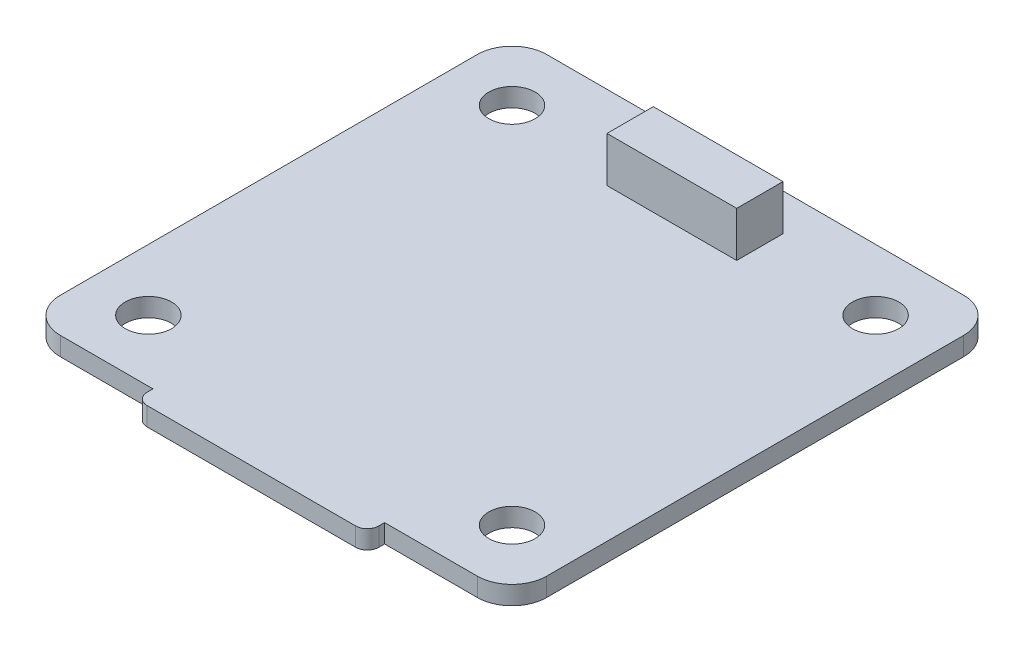
ISO-10303-21;
HEADER;
FILE_DESCRIPTION(('STEP AP214'),'2;1');
FILE_NAME('part.step','',(''),(''),'','','');
FILE_SCHEMA(('AUTOMOTIVE_DESIGN { 1 0 10303 214 1 1 1 1 }'));
ENDSEC;
DATA;
#1=APPLICATION_CONTEXT('core data for automotive mechanical design processes');
#2=APPLICATION_PROTOCOL_DEFINITION('international standard','automotive_design',2000,#1);
#3=PRODUCT_CONTEXT('',#1,'mechanical');
#4=PRODUCT('Part','Part','',(#3));
#5=PRODUCT_RELATED_PRODUCT_CATEGORY('part','',(#4));
#6=PRODUCT_DEFINITION_FORMATION('','',#4);
#7=PRODUCT_DEFINITION_CONTEXT('part definition',#1,'design');
#8=PRODUCT_DEFINITION('design','',#6,#7);
#9=PRODUCT_DEFINITION_SHAPE('','',#8);
#10=(LENGTH_UNIT() NAMED_UNIT(*) SI_UNIT(.MILLI.,.METRE.));
#11=(NAMED_UNIT(*) PLANE_ANGLE_UNIT() SI_UNIT($,.RADIAN.));
#12=(NAMED_UNIT(*) SI_UNIT($,.STERADIAN.) SOLID_ANGLE_UNIT());
#13=UNCERTAINTY_MEASURE_WITH_UNIT(LENGTH_MEASURE(1.E-05),#10,'distance_accuracy_value','');
#14=(GEOMETRIC_REPRESENTATION_CONTEXT(3) GLOBAL_UNCERTAINTY_ASSIGNED_CONTEXT((#13)) GLOBAL_UNIT_ASSIGNED_CONTEXT((#10,
#11,#12)) REPRESENTATION_CONTEXT('',''));
#15=CARTESIAN_POINT('',(0.,0.,0.));
#16=DIRECTION('',(0.,0.,1.));
#17=DIRECTION('',(1.,0.,0.));
#18=AXIS2_PLACEMENT_3D('',#15,#16,#17);
#19=CARTESIAN_POINT('',(-18.,1.6,-18.));
#20=DIRECTION('',(0.,1.,0.));
#21=DIRECTION('',(0.,0.,1.));
#22=AXIS2_PLACEMENT_3D('',#19,#20,#21);
#23=PLANE('',#22);
#24=CARTESIAN_POINT('',(15.6966991411009,1.6,-15.6966991411009));
#25=DIRECTION('',(0.,1.,0.));
#26=DIRECTION('',(0.,0.,1.));
#27=AXIS2_PLACEMENT_3D('',#24,#25,#26);
#28=CIRCLE('',#27,2.);
#29=CARTESIAN_POINT('',(15.6966991411009,1.6,-13.6966991411009));
#30=VERTEX_POINT('',#29);
#31=EDGE_CURVE('E333',#30,#30,#28,.T.);
#32=ORIENTED_EDGE('',*,*,#31,.F.);
#33=EDGE_LOOP('',(#32));
#34=FACE_BOUND('',#33,.T.);
#35=CARTESIAN_POINT('',(-15.6966991411009,1.6,15.6966991411009));
#36=DIRECTION('',(0.,1.,0.));
#37=DIRECTION('',(0.,0.,1.));
#38=AXIS2_PLACEMENT_3D('',#35,#36,#37);
#39=CIRCLE('',#38,2.);
#40=CARTESIAN_POINT('',(-15.6966991411009,1.6,17.6966991411009));
#41=VERTEX_POINT('',#40);
#42=EDGE_CURVE('E189',#41,#41,#39,.T.);
#43=ORIENTED_EDGE('',*,*,#42,.F.);
#44=EDGE_LOOP('',(#43));
#45=FACE_BOUND('',#44,.T.);
#46=CARTESIAN_POINT('',(-18.,1.6,-18.));
#47=DIRECTION('',(0.,1.,0.));
#48=DIRECTION('',(0.,0.,1.));
#49=AXIS2_PLACEMENT_3D('',#46,#47,#48);
#50=CIRCLE('',#49,3.);
#51=CARTESIAN_POINT('',(-18.,1.6,-21.));
#52=VERTEX_POINT('',#51);
#53=CARTESIAN_POINT('',(-21.,1.6,-18.));
#54=VERTEX_POINT('',#53);
#55=EDGE_CURVE('E121',#52,#54,#50,.T.);
#56=ORIENTED_EDGE('',*,*,#55,.T.);
#57=DIRECTION('',(0.,0.,-1.));
#58=VECTOR('',#57,1.);
#59=CARTESIAN_POINT('',(-21.,1.6,18.));
#60=LINE('',#59,#58);
#61=CARTESIAN_POINT('',(-21.,1.6,18.));
#62=VERTEX_POINT('',#61);
#63=EDGE_CURVE('E257',#62,#54,#60,.T.);
#64=ORIENTED_EDGE('',*,*,#63,.F.);
#65=CARTESIAN_POINT('',(-18.,1.6,18.));
#66=DIRECTION('',(0.,1.,0.));
#67=DIRECTION('',(0.,0.,1.));
#68=AXIS2_PLACEMENT_3D('',#65,#66,#67);
#69=CIRCLE('',#68,3.);
#70=CARTESIAN_POINT('',(-18.,1.6,21.));
#71=VERTEX_POINT('',#70);
#72=EDGE_CURVE('E247',#62,#71,#69,.T.);
#73=ORIENTED_EDGE('',*,*,#72,.T.);
#74=DIRECTION('',(1.,0.,0.));
#75=VECTOR('',#74,1.);
#76=CARTESIAN_POINT('',(-18.,1.6,21.));
#77=LINE('',#76,#75);
#78=CARTESIAN_POINT('',(-10.,1.6,21.));
#79=VERTEX_POINT('',#78);
#80=EDGE_CURVE('E300',#71,#79,#77,.T.);
#81=ORIENTED_EDGE('',*,*,#80,.T.);
#82=DIRECTION('',(0.,0.,1.));
#83=VECTOR('',#82,1.);
#84=CARTESIAN_POINT('',(-10.,1.6,21.));
#85=LINE('',#84,#83);
#86=CARTESIAN_POINT('',(-10.,1.6,21.5));
#87=VERTEX_POINT('',#86);
#88=EDGE_CURVE('E296',#79,#87,#85,.T.);
#89=ORIENTED_EDGE('',*,*,#88,.T.);
#90=CARTESIAN_POINT('',(-9.,1.6,21.5));
#91=DIRECTION('',(0.,-1.,0.));
#92=DIRECTION('',(0.,0.,-1.));
#93=AXIS2_PLACEMENT_3D('',#90,#91,#92);
#94=CIRCLE('',#93,0.999999999999998);
#95=CARTESIAN_POINT('',(-9.,1.6,22.5));
#96=VERTEX_POINT('',#95);
#97=EDGE_CURVE('E291',#96,#87,#94,.T.);
#98=ORIENTED_EDGE('',*,*,#97,.F.);
#99=DIRECTION('',(1.,0.,0.));
#100=VECTOR('',#99,1.);
#101=CARTESIAN_POINT('',(-9.,1.6,22.5));
#102=LINE('',#101,#100);
#103=CARTESIAN_POINT('',(9.,1.6,22.5));
#104=VERTEX_POINT('',#103);
#105=EDGE_CURVE('E307',#96,#104,#102,.T.);
#106=ORIENTED_EDGE('',*,*,#105,.T.);
#107=CARTESIAN_POINT('',(9.,1.6,21.5));
#108=DIRECTION('',(0.,-1.,0.));
#109=DIRECTION('',(0.,0.,-1.));
#110=AXIS2_PLACEMENT_3D('',#107,#108,#109);
#111=CIRCLE('',#110,0.999999999999999);
#112=CARTESIAN_POINT('',(10.,1.6,21.5));
#113=VERTEX_POINT('',#112);
#114=EDGE_CURVE('E281',#113,#104,#111,.T.);
#115=ORIENTED_EDGE('',*,*,#114,.F.);
#116=DIRECTION('',(0.,0.,-1.));
#117=VECTOR('',#116,1.);
#118=CARTESIAN_POINT('',(10.,1.6,21.5));
#119=LINE('',#118,#117);
#120=CARTESIAN_POINT('',(10.,1.6,21.));
#121=VERTEX_POINT('',#120);
#122=EDGE_CURVE('E273',#113,#121,#119,.T.);
#123=ORIENTED_EDGE('',*,*,#122,.T.);
#124=DIRECTION('',(1.,0.,0.));
#125=VECTOR('',#124,1.);
#126=CARTESIAN_POINT('',(10.,1.6,21.));
#127=LINE('',#126,#125);
#128=CARTESIAN_POINT('',(18.,1.6,21.));
#129=VERTEX_POINT('',#128);
#130=EDGE_CURVE('E268',#121,#129,#127,.T.);
#131=ORIENTED_EDGE('',*,*,#130,.T.);
#132=CARTESIAN_POINT('',(18.,1.6,18.));
#133=DIRECTION('',(0.,1.,0.));
#134=DIRECTION('',(0.,0.,1.));
#135=AXIS2_PLACEMENT_3D('',#132,#133,#134);
#136=CIRCLE('',#135,3.);
#137=CARTESIAN_POINT('',(21.,1.6,18.));
#138=VERTEX_POINT('',#137);
#139=EDGE_CURVE('E164',#129,#138,#136,.T.);
#140=ORIENTED_EDGE('',*,*,#139,.T.);
#141=DIRECTION('',(0.,0.,-1.));
#142=VECTOR('',#141,1.);
#143=CARTESIAN_POINT('',(21.,1.6,18.));
#144=LINE('',#143,#142);
#145=CARTESIAN_POINT('',(21.,1.6,-18.));
#146=VERTEX_POINT('',#145);
#147=EDGE_CURVE('E157',#138,#146,#144,.T.);
#148=ORIENTED_EDGE('',*,*,#147,.T.);
#149=CARTESIAN_POINT('',(18.,1.6,-18.));
#150=DIRECTION('',(0.,1.,0.));
#151=DIRECTION('',(0.,0.,1.));
#152=AXIS2_PLACEMENT_3D('',#149,#150,#151);
#153=CIRCLE('',#152,3.);
#154=CARTESIAN_POINT('',(18.,1.6,-21.));
#155=VERTEX_POINT('',#154);
#156=EDGE_CURVE('E161',#146,#155,#153,.T.);
#157=ORIENTED_EDGE('',*,*,#156,.T.);
#158=DIRECTION('',(1.,0.,0.));
#159=VECTOR('',#158,1.);
#160=CARTESIAN_POINT('',(-18.,1.6,-21.));
#161=LINE('',#160,#159);
#162=EDGE_CURVE('E181',#52,#155,#161,.T.);
#163=ORIENTED_EDGE('',*,*,#162,.F.);
#164=EDGE_LOOP('',(#56,#64,#73,#81,#89,#98,#106,#115,#123,#131,#140,#148,#157,#163));
#165=FACE_BOUND('',#164,.T.);
#166=CARTESIAN_POINT('',(-15.6966991411009,1.6,-15.6966991411009));
#167=DIRECTION('',(0.,1.,0.));
#168=DIRECTION('',(0.,0.,1.));
#169=AXIS2_PLACEMENT_3D('',#166,#167,#168);
#170=CIRCLE('',#169,2.);
#171=CARTESIAN_POINT('',(-15.6966991411009,1.6,-13.6966991411009));
#172=VERTEX_POINT('',#171);
#173=EDGE_CURVE('E323',#172,#172,#170,.F.);
#174=ORIENTED_EDGE('',*,*,#173,.T.);
#175=EDGE_LOOP('',(#174));
#176=FACE_BOUND('',#175,.T.);
#177=CARTESIAN_POINT('',(15.6966991411009,1.6,15.6966991411009));
#178=DIRECTION('',(0.,1.,0.));
#179=DIRECTION('',(0.,0.,1.));
#180=AXIS2_PLACEMENT_3D('',#177,#178,#179);
#181=CIRCLE('',#180,2.);
#182=CARTESIAN_POINT('',(15.6966991411009,1.6,17.6966991411009));
#183=VERTEX_POINT('',#182);
#184=EDGE_CURVE('E322',#183,#183,#181,.F.);
#185=ORIENTED_EDGE('',*,*,#184,.T.);
#186=EDGE_LOOP('',(#185));
#187=FACE_BOUND('',#186,.T.);
#188=DIRECTION('',(-1.,0.,0.));
#189=VECTOR('',#188,1.);
#190=CARTESIAN_POINT('',(-5.6,1.6,-17.8));
#191=LINE('',#190,#189);
#192=CARTESIAN_POINT('',(5.6,1.6,-17.8));
#193=VERTEX_POINT('',#192);
#194=CARTESIAN_POINT('',(-5.6,1.6,-17.8));
#195=VERTEX_POINT('',#194);
#196=EDGE_CURVE('E352',#193,#195,#191,.T.);
#197=ORIENTED_EDGE('',*,*,#196,.F.);
#198=DIRECTION('',(0.,0.,-1.));
#199=VECTOR('',#198,1.);
#200=CARTESIAN_POINT('',(5.6,1.6,-13.8));
#201=LINE('',#200,#199);
#202=CARTESIAN_POINT('',(5.6,1.6,-13.8));
#203=VERTEX_POINT('',#202);
#204=EDGE_CURVE('E355',#203,#193,#201,.T.);
#205=ORIENTED_EDGE('',*,*,#204,.F.);
#206=DIRECTION('',(1.,0.,0.));
#207=VECTOR('',#206,1.);
#208=CARTESIAN_POINT('',(-5.6,1.6,-13.8));
#209=LINE('',#208,#207);
#210=CARTESIAN_POINT('',(-5.6,1.6,-13.8));
#211=VERTEX_POINT('',#210);
#212=EDGE_CURVE('E347',#211,#203,#209,.T.);
#213=ORIENTED_EDGE('',*,*,#212,.F.);
#214=DIRECTION('',(0.,0.,1.));
#215=VECTOR('',#214,1.);
#216=CARTESIAN_POINT('',(-5.6,1.6,-13.8));
#217=LINE('',#216,#215);
#218=EDGE_CURVE('E350',#195,#211,#217,.T.);
#219=ORIENTED_EDGE('',*,*,#218,.F.);
#220=EDGE_LOOP('',(#197,#205,#213,#219));
#221=FACE_BOUND('',#220,.T.);
#222=ADVANCED_FACE('F41',(#34,#45,#165,#176,#187,#221),#23,.T.);
#223=CARTESIAN_POINT('',(-18.,0.,-18.));
#224=DIRECTION('',(0.,1.,0.));
#225=DIRECTION('',(0.,0.,1.));
#226=AXIS2_PLACEMENT_3D('',#223,#224,#225);
#227=PLANE('',#226);
#228=CARTESIAN_POINT('',(-15.6966991411009,0.,-15.6966991411009));
#229=DIRECTION('',(0.,-1.,0.));
#230=DIRECTION('',(0.,0.,-1.));
#231=AXIS2_PLACEMENT_3D('',#228,#229,#230);
#232=CIRCLE('',#231,2.);
#233=CARTESIAN_POINT('',(-15.6966991411009,0.,-17.6966991411009));
#234=VERTEX_POINT('',#233);
#235=EDGE_CURVE('E319',#234,#234,#232,.T.);
#236=ORIENTED_EDGE('',*,*,#235,.F.);
#237=EDGE_LOOP('',(#236));
#238=FACE_BOUND('',#237,.T.);
#239=CARTESIAN_POINT('',(15.6966991411009,0.,-15.6966991411009));
#240=DIRECTION('',(0.,1.,0.));
#241=DIRECTION('',(0.,0.,1.));
#242=AXIS2_PLACEMENT_3D('',#239,#240,#241);
#243=CIRCLE('',#242,2.);
#244=CARTESIAN_POINT('',(15.6966991411009,0.,-13.6966991411009));
#245=VERTEX_POINT('',#244);
#246=EDGE_CURVE('E326',#245,#245,#243,.T.);
#247=ORIENTED_EDGE('',*,*,#246,.T.);
#248=EDGE_LOOP('',(#247));
#249=FACE_BOUND('',#248,.T.);
#250=CARTESIAN_POINT('',(-15.6966991411009,0.,15.6966991411009));
#251=DIRECTION('',(0.,1.,0.));
#252=DIRECTION('',(0.,0.,1.));
#253=AXIS2_PLACEMENT_3D('',#250,#251,#252);
#254=CIRCLE('',#253,2.);
#255=CARTESIAN_POINT('',(-15.6966991411009,0.,17.6966991411009));
#256=VERTEX_POINT('',#255);
#257=EDGE_CURVE('E315',#256,#256,#254,.T.);
#258=ORIENTED_EDGE('',*,*,#257,.T.);
#259=EDGE_LOOP('',(#258));
#260=FACE_BOUND('',#259,.T.);
#261=CARTESIAN_POINT('',(-18.,0.,-18.));
#262=DIRECTION('',(0.,1.,0.));
#263=DIRECTION('',(0.,0.,1.));
#264=AXIS2_PLACEMENT_3D('',#261,#262,#263);
#265=CIRCLE('',#264,3.);
#266=CARTESIAN_POINT('',(-18.,0.,-21.));
#267=VERTEX_POINT('',#266);
#268=CARTESIAN_POINT('',(-21.,0.,-18.));
#269=VERTEX_POINT('',#268);
#270=EDGE_CURVE('E186',#267,#269,#265,.T.);
#271=ORIENTED_EDGE('',*,*,#270,.F.);
#272=DIRECTION('',(1.,0.,0.));
#273=VECTOR('',#272,1.);
#274=CARTESIAN_POINT('',(-18.,0.,-21.));
#275=LINE('',#274,#273);
#276=CARTESIAN_POINT('',(18.,0.,-21.));
#277=VERTEX_POINT('',#276);
#278=EDGE_CURVE('E217',#267,#277,#275,.T.);
#279=ORIENTED_EDGE('',*,*,#278,.T.);
#280=CARTESIAN_POINT('',(18.,0.,-18.));
#281=DIRECTION('',(0.,1.,0.));
#282=DIRECTION('',(0.,0.,1.));
#283=AXIS2_PLACEMENT_3D('',#280,#281,#282);
#284=CIRCLE('',#283,3.);
#285=CARTESIAN_POINT('',(21.,0.,-18.));
#286=VERTEX_POINT('',#285);
#287=EDGE_CURVE('E215',#286,#277,#284,.T.);
#288=ORIENTED_EDGE('',*,*,#287,.F.);
#289=DIRECTION('',(0.,0.,-1.));
#290=VECTOR('',#289,1.);
#291=CARTESIAN_POINT('',(21.,0.,18.));
#292=LINE('',#291,#290);
#293=CARTESIAN_POINT('',(21.,0.,18.));
#294=VERTEX_POINT('',#293);
#295=EDGE_CURVE('E173',#294,#286,#292,.T.);
#296=ORIENTED_EDGE('',*,*,#295,.F.);
#297=CARTESIAN_POINT('',(18.,0.,18.));
#298=DIRECTION('',(0.,1.,0.));
#299=DIRECTION('',(0.,0.,1.));
#300=AXIS2_PLACEMENT_3D('',#297,#298,#299);
#301=CIRCLE('',#300,3.);
#302=CARTESIAN_POINT('',(18.,0.,21.));
#303=VERTEX_POINT('',#302);
#304=EDGE_CURVE('E212',#303,#294,#301,.T.);
#305=ORIENTED_EDGE('',*,*,#304,.F.);
#306=DIRECTION('',(1.,0.,0.));
#307=VECTOR('',#306,1.);
#308=CARTESIAN_POINT('',(10.,0.,21.));
#309=LINE('',#308,#307);
#310=CARTESIAN_POINT('',(10.,0.,21.));
#311=VERTEX_POINT('',#310);
#312=EDGE_CURVE('E210',#311,#303,#309,.T.);
#313=ORIENTED_EDGE('',*,*,#312,.F.);
#314=DIRECTION('',(0.,0.,-1.));
#315=VECTOR('',#314,1.);
#316=CARTESIAN_POINT('',(10.,0.,21.5));
#317=LINE('',#316,#315);
#318=CARTESIAN_POINT('',(10.,0.,21.5));
#319=VERTEX_POINT('',#318);
#320=EDGE_CURVE('E208',#319,#311,#317,.T.);
#321=ORIENTED_EDGE('',*,*,#320,.F.);
#322=CARTESIAN_POINT('',(9.,0.,21.5));
#323=DIRECTION('',(0.,-1.,0.));
#324=DIRECTION('',(0.,0.,-1.));
#325=AXIS2_PLACEMENT_3D('',#322,#323,#324);
#326=CIRCLE('',#325,0.999999999999999);
#327=CARTESIAN_POINT('',(9.,0.,22.5));
#328=VERTEX_POINT('',#327);
#329=EDGE_CURVE('E205',#319,#328,#326,.T.);
#330=ORIENTED_EDGE('',*,*,#329,.T.);
#331=DIRECTION('',(1.,0.,0.));
#332=VECTOR('',#331,1.);
#333=CARTESIAN_POINT('',(-9.,0.,22.5));
#334=LINE('',#333,#332);
#335=CARTESIAN_POINT('',(-9.,0.,22.5));
#336=VERTEX_POINT('',#335);
#337=EDGE_CURVE('E202',#336,#328,#334,.T.);
#338=ORIENTED_EDGE('',*,*,#337,.F.);
#339=CARTESIAN_POINT('',(-9.,0.,21.5));
#340=DIRECTION('',(0.,-1.,0.));
#341=DIRECTION('',(0.,0.,-1.));
#342=AXIS2_PLACEMENT_3D('',#339,#340,#341);
#343=CIRCLE('',#342,0.999999999999998);
#344=CARTESIAN_POINT('',(-10.,0.,21.5));
#345=VERTEX_POINT('',#344);
#346=EDGE_CURVE('E199',#336,#345,#343,.T.);
#347=ORIENTED_EDGE('',*,*,#346,.T.);
#348=DIRECTION('',(0.,0.,1.));
#349=VECTOR('',#348,1.);
#350=CARTESIAN_POINT('',(-10.,0.,21.));
#351=LINE('',#350,#349);
#352=CARTESIAN_POINT('',(-10.,0.,21.));
#353=VERTEX_POINT('',#352);
#354=EDGE_CURVE('E196',#353,#345,#351,.T.);
#355=ORIENTED_EDGE('',*,*,#354,.F.);
#356=DIRECTION('',(1.,0.,0.));
#357=VECTOR('',#356,1.);
#358=CARTESIAN_POINT('',(-18.,0.,21.));
#359=LINE('',#358,#357);
#360=CARTESIAN_POINT('',(-18.,0.,21.));
#361=VERTEX_POINT('',#360);
#362=EDGE_CURVE('E194',#361,#353,#359,.T.);
#363=ORIENTED_EDGE('',*,*,#362,.F.);
#364=CARTESIAN_POINT('',(-18.,0.,18.));
#365=DIRECTION('',(0.,1.,0.));
#366=DIRECTION('',(0.,0.,1.));
#367=AXIS2_PLACEMENT_3D('',#364,#365,#366);
#368=CIRCLE('',#367,3.);
#369=CARTESIAN_POINT('',(-21.,0.,18.));
#370=VERTEX_POINT('',#369);
#371=EDGE_CURVE('E192',#370,#361,#368,.T.);
#372=ORIENTED_EDGE('',*,*,#371,.F.);
#373=DIRECTION('',(0.,0.,-1.));
#374=VECTOR('',#373,1.);
#375=CARTESIAN_POINT('',(-21.,0.,18.));
#376=LINE('',#375,#374);
#377=EDGE_CURVE('E188',#370,#269,#376,.T.);
#378=ORIENTED_EDGE('',*,*,#377,.T.);
#379=EDGE_LOOP('',(#271,#279,#288,#296,#305,#313,#321,#330,#338,#347,#355,#363,#372,#378));
#380=FACE_BOUND('',#379,.T.);
#381=CARTESIAN_POINT('',(15.6966991411009,0.,15.6966991411009));
#382=DIRECTION('',(0.,-1.,0.));
#383=DIRECTION('',(0.,0.,-1.));
#384=AXIS2_PLACEMENT_3D('',#381,#382,#383);
#385=CIRCLE('',#384,2.);
#386=CARTESIAN_POINT('',(15.6966991411009,0.,13.6966991411009));
#387=VERTEX_POINT('',#386);
#388=EDGE_CURVE('E318',#387,#387,#385,.T.);
#389=ORIENTED_EDGE('',*,*,#388,.F.);
#390=EDGE_LOOP('',(#389));
#391=FACE_BOUND('',#390,.T.);
#392=ADVANCED_FACE('F253',(#238,#249,#260,#380,#391),#227,.F.);
#393=CARTESIAN_POINT('',(-18.,1.6,-18.));
#394=DIRECTION('',(0.,-1.,0.));
#395=DIRECTION('',(0.,0.,-1.));
#396=AXIS2_PLACEMENT_3D('',#393,#394,#395);
#397=CYLINDRICAL_SURFACE('',#396,3.);
#398=ORIENTED_EDGE('',*,*,#270,.T.);
#399=DIRECTION('',(0.,-1.,0.));
#400=VECTOR('',#399,1.);
#401=CARTESIAN_POINT('',(-21.,1.6,-18.));
#402=LINE('',#401,#400);
#403=EDGE_CURVE('E11',#54,#269,#402,.T.);
#404=ORIENTED_EDGE('',*,*,#403,.F.);
#405=ORIENTED_EDGE('',*,*,#55,.F.);
#406=DIRECTION('',(0.,-1.,0.));
#407=VECTOR('',#406,1.);
#408=CARTESIAN_POINT('',(-18.,1.6,-21.));
#409=LINE('',#408,#407);
#410=EDGE_CURVE('E65',#52,#267,#409,.T.);
#411=ORIENTED_EDGE('',*,*,#410,.T.);
#412=EDGE_LOOP('',(#398,#404,#405,#411));
#413=FACE_BOUND('',#412,.T.);
#414=ADVANCED_FACE('F43',(#413),#397,.T.);
#415=CARTESIAN_POINT('',(-21.,1.6,18.));
#416=DIRECTION('',(-1.,0.,0.));
#417=DIRECTION('',(0.,0.,1.));
#418=AXIS2_PLACEMENT_3D('',#415,#416,#417);
#419=PLANE('',#418);
#420=ORIENTED_EDGE('',*,*,#377,.F.);
#421=DIRECTION('',(0.,-1.,0.));
#422=VECTOR('',#421,1.);
#423=CARTESIAN_POINT('',(-21.,1.6,18.));
#424=LINE('',#423,#422);
#425=EDGE_CURVE('E49',#62,#370,#424,.T.);
#426=ORIENTED_EDGE('',*,*,#425,.F.);
#427=ORIENTED_EDGE('',*,*,#63,.T.);
#428=ORIENTED_EDGE('',*,*,#403,.T.);
#429=EDGE_LOOP('',(#420,#426,#427,#428));
#430=FACE_BOUND('',#429,.T.);
#431=ADVANCED_FACE('F256',(#430),#419,.T.);
#432=CARTESIAN_POINT('',(-18.,1.6,18.));
#433=DIRECTION('',(0.,-1.,0.));
#434=DIRECTION('',(0.,0.,-1.));
#435=AXIS2_PLACEMENT_3D('',#432,#433,#434);
#436=CYLINDRICAL_SURFACE('',#435,3.);
#437=ORIENTED_EDGE('',*,*,#371,.T.);
#438=DIRECTION('',(0.,-1.,0.));
#439=VECTOR('',#438,1.);
#440=CARTESIAN_POINT('',(-18.,1.6,21.));
#441=LINE('',#440,#439);
#442=EDGE_CURVE('E240',#71,#361,#441,.T.);
#443=ORIENTED_EDGE('',*,*,#442,.F.);
#444=ORIENTED_EDGE('',*,*,#72,.F.);
#445=ORIENTED_EDGE('',*,*,#425,.T.);
#446=EDGE_LOOP('',(#437,#443,#444,#445));
#447=FACE_BOUND('',#446,.T.);
#448=ADVANCED_FACE('F245',(#447),#436,.T.);
#449=CARTESIAN_POINT('',(-18.,1.6,21.));
#450=DIRECTION('',(0.,0.,-1.));
#451=DIRECTION('',(-1.,0.,0.));
#452=AXIS2_PLACEMENT_3D('',#449,#450,#451);
#453=PLANE('',#452);
#454=ORIENTED_EDGE('',*,*,#362,.T.);
#455=DIRECTION('',(0.,-1.,0.));
#456=VECTOR('',#455,1.);
#457=CARTESIAN_POINT('',(-10.,1.6,21.));
#458=LINE('',#457,#456);
#459=EDGE_CURVE('E237',#79,#353,#458,.T.);
#460=ORIENTED_EDGE('',*,*,#459,.F.);
#461=ORIENTED_EDGE('',*,*,#80,.F.);
#462=ORIENTED_EDGE('',*,*,#442,.T.);
#463=EDGE_LOOP('',(#454,#460,#461,#462));
#464=FACE_BOUND('',#463,.T.);
#465=ADVANCED_FACE('F299',(#464),#453,.F.);
#466=CARTESIAN_POINT('',(-10.,1.6,21.));
#467=DIRECTION('',(1.,0.,0.));
#468=DIRECTION('',(0.,0.,-1.));
#469=AXIS2_PLACEMENT_3D('',#466,#467,#468);
#470=PLANE('',#469);
#471=ORIENTED_EDGE('',*,*,#354,.T.);
#472=DIRECTION('',(0.,-1.,0.));
#473=VECTOR('',#472,1.);
#474=CARTESIAN_POINT('',(-10.,1.6,21.5));
#475=LINE('',#474,#473);
#476=EDGE_CURVE('E235',#87,#345,#475,.T.);
#477=ORIENTED_EDGE('',*,*,#476,.F.);
#478=ORIENTED_EDGE('',*,*,#88,.F.);
#479=ORIENTED_EDGE('',*,*,#459,.T.);
#480=EDGE_LOOP('',(#471,#477,#478,#479));
#481=FACE_BOUND('',#480,.T.);
#482=ADVANCED_FACE('F294',(#481),#470,.F.);
#483=CARTESIAN_POINT('',(-9.,1.6,21.5));
#484=DIRECTION('',(0.,-1.,0.));
#485=DIRECTION('',(0.,0.,-1.));
#486=AXIS2_PLACEMENT_3D('',#483,#484,#485);
#487=CYLINDRICAL_SURFACE('',#486,0.999999999999998);
#488=ORIENTED_EDGE('',*,*,#346,.F.);
#489=DIRECTION('',(0.,-1.,0.));
#490=VECTOR('',#489,1.);
#491=CARTESIAN_POINT('',(-9.,1.6,22.5));
#492=LINE('',#491,#490);
#493=EDGE_CURVE('E233',#96,#336,#492,.T.);
#494=ORIENTED_EDGE('',*,*,#493,.F.);
#495=ORIENTED_EDGE('',*,*,#97,.T.);
#496=ORIENTED_EDGE('',*,*,#476,.T.);
#497=EDGE_LOOP('',(#488,#494,#495,#496));
#498=FACE_BOUND('',#497,.T.);
#499=ADVANCED_FACE('F287',(#498),#487,.T.);
#500=CARTESIAN_POINT('',(-9.,1.6,22.5));
#501=DIRECTION('',(0.,0.,-1.));
#502=DIRECTION('',(-1.,0.,0.));
#503=AXIS2_PLACEMENT_3D('',#500,#501,#502);
#504=PLANE('',#503);
#505=ORIENTED_EDGE('',*,*,#337,.T.);
#506=DIRECTION('',(0.,-1.,0.));
#507=VECTOR('',#506,1.);
#508=CARTESIAN_POINT('',(9.,1.6,22.5));
#509=LINE('',#508,#507);
#510=EDGE_CURVE('E231',#104,#328,#509,.T.);
#511=ORIENTED_EDGE('',*,*,#510,.F.);
#512=ORIENTED_EDGE('',*,*,#105,.F.);
#513=ORIENTED_EDGE('',*,*,#493,.T.);
#514=EDGE_LOOP('',(#505,#511,#512,#513));
#515=FACE_BOUND('',#514,.T.);
#516=ADVANCED_FACE('F284',(#515),#504,.F.);
#517=CARTESIAN_POINT('',(9.,1.6,21.5));
#518=DIRECTION('',(0.,-1.,0.));
#519=DIRECTION('',(0.,0.,-1.));
#520=AXIS2_PLACEMENT_3D('',#517,#518,#519);
#521=CYLINDRICAL_SURFACE('',#520,0.999999999999999);
#522=ORIENTED_EDGE('',*,*,#329,.F.);
#523=DIRECTION('',(0.,-1.,0.));
#524=VECTOR('',#523,1.);
#525=CARTESIAN_POINT('',(10.,1.6,21.5));
#526=LINE('',#525,#524);
#527=EDGE_CURVE('E229',#113,#319,#526,.T.);
#528=ORIENTED_EDGE('',*,*,#527,.F.);
#529=ORIENTED_EDGE('',*,*,#114,.T.);
#530=ORIENTED_EDGE('',*,*,#510,.T.);
#531=EDGE_LOOP('',(#522,#528,#529,#530));
#532=FACE_BOUND('',#531,.T.);
#533=ADVANCED_FACE('F278',(#532),#521,.T.);
#534=CARTESIAN_POINT('',(10.,1.6,21.5));
#535=DIRECTION('',(-1.,0.,0.));
#536=DIRECTION('',(0.,0.,1.));
#537=AXIS2_PLACEMENT_3D('',#534,#535,#536);
#538=PLANE('',#537);
#539=ORIENTED_EDGE('',*,*,#320,.T.);
#540=DIRECTION('',(0.,-1.,0.));
#541=VECTOR('',#540,1.);
#542=CARTESIAN_POINT('',(10.,1.6,21.));
#543=LINE('',#542,#541);
#544=EDGE_CURVE('E226',#121,#311,#543,.T.);
#545=ORIENTED_EDGE('',*,*,#544,.F.);
#546=ORIENTED_EDGE('',*,*,#122,.F.);
#547=ORIENTED_EDGE('',*,*,#527,.T.);
#548=EDGE_LOOP('',(#539,#545,#546,#547));
#549=FACE_BOUND('',#548,.T.);
#550=ADVANCED_FACE('F272',(#549),#538,.F.);
#551=CARTESIAN_POINT('',(10.,1.6,21.));
#552=DIRECTION('',(0.,0.,-1.));
#553=DIRECTION('',(-1.,0.,0.));
#554=AXIS2_PLACEMENT_3D('',#551,#552,#553);
#555=PLANE('',#554);
#556=ORIENTED_EDGE('',*,*,#312,.T.);
#557=DIRECTION('',(0.,-1.,0.));
#558=VECTOR('',#557,1.);
#559=CARTESIAN_POINT('',(18.,1.6,21.));
#560=LINE('',#559,#558);
#561=EDGE_CURVE('E223',#129,#303,#560,.T.);
#562=ORIENTED_EDGE('',*,*,#561,.F.);
#563=ORIENTED_EDGE('',*,*,#130,.F.);
#564=ORIENTED_EDGE('',*,*,#544,.T.);
#565=EDGE_LOOP('',(#556,#562,#563,#564));
#566=FACE_BOUND('',#565,.T.);
#567=ADVANCED_FACE('F267',(#566),#555,.F.);
#568=CARTESIAN_POINT('',(18.,1.6,18.));
#569=DIRECTION('',(0.,-1.,0.));
#570=DIRECTION('',(0.,0.,-1.));
#571=AXIS2_PLACEMENT_3D('',#568,#569,#570);
#572=CYLINDRICAL_SURFACE('',#571,3.);
#573=ORIENTED_EDGE('',*,*,#304,.T.);
#574=DIRECTION('',(0.,-1.,0.));
#575=VECTOR('',#574,1.);
#576=CARTESIAN_POINT('',(21.,1.6,18.));
#577=LINE('',#576,#575);
#578=EDGE_CURVE('E177',#138,#294,#577,.T.);
#579=ORIENTED_EDGE('',*,*,#578,.F.);
#580=ORIENTED_EDGE('',*,*,#139,.F.);
#581=ORIENTED_EDGE('',*,*,#561,.T.);
#582=EDGE_LOOP('',(#573,#579,#580,#581));
#583=FACE_BOUND('',#582,.T.);
#584=ADVANCED_FACE('F263',(#583),#572,.T.);
#585=CARTESIAN_POINT('',(21.,1.6,18.));
#586=DIRECTION('',(-1.,0.,0.));
#587=DIRECTION('',(0.,0.,1.));
#588=AXIS2_PLACEMENT_3D('',#585,#586,#587);
#589=PLANE('',#588);
#590=ORIENTED_EDGE('',*,*,#295,.T.);
#591=DIRECTION('',(0.,-1.,0.));
#592=VECTOR('',#591,1.);
#593=CARTESIAN_POINT('',(21.,1.6,-18.));
#594=LINE('',#593,#592);
#595=EDGE_CURVE('E170',#146,#286,#594,.T.);
#596=ORIENTED_EDGE('',*,*,#595,.F.);
#597=ORIENTED_EDGE('',*,*,#147,.F.);
#598=ORIENTED_EDGE('',*,*,#578,.T.);
#599=EDGE_LOOP('',(#590,#596,#597,#598));
#600=FACE_BOUND('',#599,.T.);
#601=ADVANCED_FACE('F171',(#600),#589,.F.);
#602=CARTESIAN_POINT('',(18.,1.6,-18.));
#603=DIRECTION('',(0.,-1.,0.));
#604=DIRECTION('',(0.,0.,-1.));
#605=AXIS2_PLACEMENT_3D('',#602,#603,#604);
#606=CYLINDRICAL_SURFACE('',#605,3.);
#607=ORIENTED_EDGE('',*,*,#287,.T.);
#608=DIRECTION('',(0.,-1.,0.));
#609=VECTOR('',#608,1.);
#610=CARTESIAN_POINT('',(18.,1.6,-21.));
#611=LINE('',#610,#609);
#612=EDGE_CURVE('E178',#155,#277,#611,.T.);
#613=ORIENTED_EDGE('',*,*,#612,.F.);
#614=ORIENTED_EDGE('',*,*,#156,.F.);
#615=ORIENTED_EDGE('',*,*,#595,.T.);
#616=EDGE_LOOP('',(#607,#613,#614,#615));
#617=FACE_BOUND('',#616,.T.);
#618=ADVANCED_FACE('F180',(#617),#606,.T.);
#619=CARTESIAN_POINT('',(-18.,1.6,-21.));
#620=DIRECTION('',(0.,0.,-1.));
#621=DIRECTION('',(-1.,0.,0.));
#622=AXIS2_PLACEMENT_3D('',#619,#620,#621);
#623=PLANE('',#622);
#624=ORIENTED_EDGE('',*,*,#278,.F.);
#625=ORIENTED_EDGE('',*,*,#410,.F.);
#626=ORIENTED_EDGE('',*,*,#162,.T.);
#627=ORIENTED_EDGE('',*,*,#612,.T.);
#628=EDGE_LOOP('',(#624,#625,#626,#627));
#629=FACE_BOUND('',#628,.T.);
#630=ADVANCED_FACE('F258',(#629),#623,.T.);
#631=CARTESIAN_POINT('',(-15.6966991411009,7.25685424949238,15.6966991411009));
#632=DIRECTION('',(0.,-1.,0.));
#633=DIRECTION('',(0.,0.,-1.));
#634=AXIS2_PLACEMENT_3D('',#631,#632,#633);
#635=CYLINDRICAL_SURFACE('',#634,2.);
#636=ORIENTED_EDGE('',*,*,#257,.F.);
#637=EDGE_LOOP('',(#636));
#638=FACE_BOUND('',#637,.T.);
#639=ORIENTED_EDGE('',*,*,#42,.T.);
#640=EDGE_LOOP('',(#639));
#641=FACE_BOUND('',#640,.T.);
#642=ADVANCED_FACE('F408',(#638,#641),#635,.F.);
#643=CARTESIAN_POINT('',(15.6966991411009,7.25685424949238,-15.6966991411009));
#644=DIRECTION('',(0.,-1.,0.));
#645=DIRECTION('',(0.,0.,-1.));
#646=AXIS2_PLACEMENT_3D('',#643,#644,#645);
#647=CYLINDRICAL_SURFACE('',#646,2.);
#648=ORIENTED_EDGE('',*,*,#246,.F.);
#649=EDGE_LOOP('',(#648));
#650=FACE_BOUND('',#649,.T.);
#651=ORIENTED_EDGE('',*,*,#31,.T.);
#652=EDGE_LOOP('',(#651));
#653=FACE_BOUND('',#652,.T.);
#654=ADVANCED_FACE('F458',(#650,#653),#647,.F.);
#655=CARTESIAN_POINT('',(-15.6966991411009,7.25685424949238,-15.6966991411009));
#656=DIRECTION('',(0.,-1.,0.));
#657=DIRECTION('',(0.,0.,-1.));
#658=AXIS2_PLACEMENT_3D('',#655,#656,#657);
#659=CYLINDRICAL_SURFACE('',#658,2.);
#660=ORIENTED_EDGE('',*,*,#235,.T.);
#661=EDGE_LOOP('',(#660));
#662=FACE_BOUND('',#661,.T.);
#663=ORIENTED_EDGE('',*,*,#173,.F.);
#664=EDGE_LOOP('',(#663));
#665=FACE_BOUND('',#664,.T.);
#666=ADVANCED_FACE('F468',(#662,#665),#659,.F.);
#667=CARTESIAN_POINT('',(15.6966991411009,7.25685424949238,15.6966991411009));
#668=DIRECTION('',(0.,-1.,0.));
#669=DIRECTION('',(0.,0.,-1.));
#670=AXIS2_PLACEMENT_3D('',#667,#668,#669);
#671=CYLINDRICAL_SURFACE('',#670,2.);
#672=ORIENTED_EDGE('',*,*,#388,.T.);
#673=EDGE_LOOP('',(#672));
#674=FACE_BOUND('',#673,.T.);
#675=ORIENTED_EDGE('',*,*,#184,.F.);
#676=EDGE_LOOP('',(#675));
#677=FACE_BOUND('',#676,.T.);
#678=ADVANCED_FACE('F479',(#674,#677),#671,.F.);
#679=CARTESIAN_POINT('',(5.6,5.5,-13.8));
#680=DIRECTION('',(-1.,0.,0.));
#681=DIRECTION('',(0.,0.,1.));
#682=AXIS2_PLACEMENT_3D('',#679,#680,#681);
#683=PLANE('',#682);
#684=ORIENTED_EDGE('',*,*,#204,.T.);
#685=DIRECTION('',(0.,-1.,0.));
#686=VECTOR('',#685,1.);
#687=CARTESIAN_POINT('',(5.6,5.5,-17.8));
#688=LINE('',#687,#686);
#689=CARTESIAN_POINT('',(5.6,5.5,-17.8));
#690=VERTEX_POINT('',#689);
#691=EDGE_CURVE('E336',#690,#193,#688,.T.);
#692=ORIENTED_EDGE('',*,*,#691,.F.);
#693=DIRECTION('',(0.,0.,-1.));
#694=VECTOR('',#693,1.);
#695=CARTESIAN_POINT('',(5.6,5.5,-13.8));
#696=LINE('',#695,#694);
#697=CARTESIAN_POINT('',(5.6,5.5,-13.8));
#698=VERTEX_POINT('',#697);
#699=EDGE_CURVE('E349',#698,#690,#696,.T.);
#700=ORIENTED_EDGE('',*,*,#699,.F.);
#701=DIRECTION('',(0.,-1.,0.));
#702=VECTOR('',#701,1.);
#703=CARTESIAN_POINT('',(5.6,5.5,-13.8));
#704=LINE('',#703,#702);
#705=EDGE_CURVE('E343',#698,#203,#704,.T.);
#706=ORIENTED_EDGE('',*,*,#705,.T.);
#707=EDGE_LOOP('',(#684,#692,#700,#706));
#708=FACE_BOUND('',#707,.T.);
#709=ADVANCED_FACE('F378',(#708),#683,.F.);
#710=CARTESIAN_POINT('',(-5.6,5.5,-17.8));
#711=DIRECTION('',(0.,0.,1.));
#712=DIRECTION('',(1.,0.,0.));
#713=AXIS2_PLACEMENT_3D('',#710,#711,#712);
#714=PLANE('',#713);
#715=ORIENTED_EDGE('',*,*,#196,.T.);
#716=DIRECTION('',(0.,-1.,0.));
#717=VECTOR('',#716,1.);
#718=CARTESIAN_POINT('',(-5.6,5.5,-17.8));
#719=LINE('',#718,#717);
#720=CARTESIAN_POINT('',(-5.6,5.5,-17.8));
#721=VERTEX_POINT('',#720);
#722=EDGE_CURVE('E339',#721,#195,#719,.T.);
#723=ORIENTED_EDGE('',*,*,#722,.F.);
#724=DIRECTION('',(-1.,0.,0.));
#725=VECTOR('',#724,1.);
#726=CARTESIAN_POINT('',(-5.6,5.5,-17.8));
#727=LINE('',#726,#725);
#728=EDGE_CURVE('E363',#690,#721,#727,.T.);
#729=ORIENTED_EDGE('',*,*,#728,.F.);
#730=ORIENTED_EDGE('',*,*,#691,.T.);
#731=EDGE_LOOP('',(#715,#723,#729,#730));
#732=FACE_BOUND('',#731,.T.);
#733=ADVANCED_FACE('F383',(#732),#714,.F.);
#734=CARTESIAN_POINT('',(-5.6,5.5,-13.8));
#735=DIRECTION('',(1.,0.,0.));
#736=DIRECTION('',(0.,0.,-1.));
#737=AXIS2_PLACEMENT_3D('',#734,#735,#736);
#738=PLANE('',#737);
#739=ORIENTED_EDGE('',*,*,#218,.T.);
#740=DIRECTION('',(0.,-1.,0.));
#741=VECTOR('',#740,1.);
#742=CARTESIAN_POINT('',(-5.6,5.5,-13.8));
#743=LINE('',#742,#741);
#744=CARTESIAN_POINT('',(-5.6,5.5,-13.8));
#745=VERTEX_POINT('',#744);
#746=EDGE_CURVE('E56',#745,#211,#743,.T.);
#747=ORIENTED_EDGE('',*,*,#746,.F.);
#748=DIRECTION('',(0.,0.,1.));
#749=VECTOR('',#748,1.);
#750=CARTESIAN_POINT('',(-5.6,5.5,-13.8));
#751=LINE('',#750,#749);
#752=EDGE_CURVE('E360',#721,#745,#751,.T.);
#753=ORIENTED_EDGE('',*,*,#752,.F.);
#754=ORIENTED_EDGE('',*,*,#722,.T.);
#755=EDGE_LOOP('',(#739,#747,#753,#754));
#756=FACE_BOUND('',#755,.T.);
#757=ADVANCED_FACE('F392',(#756),#738,.F.);
#758=CARTESIAN_POINT('',(-5.6,5.5,-13.8));
#759=DIRECTION('',(0.,0.,-1.));
#760=DIRECTION('',(-1.,0.,0.));
#761=AXIS2_PLACEMENT_3D('',#758,#759,#760);
#762=PLANE('',#761);
#763=ORIENTED_EDGE('',*,*,#212,.T.);
#764=ORIENTED_EDGE('',*,*,#705,.F.);
#765=DIRECTION('',(1.,0.,0.));
#766=VECTOR('',#765,1.);
#767=CARTESIAN_POINT('',(-5.6,5.5,-13.8));
#768=LINE('',#767,#766);
#769=EDGE_CURVE('E346',#745,#698,#768,.T.);
#770=ORIENTED_EDGE('',*,*,#769,.F.);
#771=ORIENTED_EDGE('',*,*,#746,.T.);
#772=EDGE_LOOP('',(#763,#764,#770,#771));
#773=FACE_BOUND('',#772,.T.);
#774=ADVANCED_FACE('F395',(#773),#762,.F.);
#775=CARTESIAN_POINT('',(0.,5.5,0.));
#776=DIRECTION('',(0.,-1.,0.));
#777=DIRECTION('',(0.,0.,-1.));
#778=AXIS2_PLACEMENT_3D('',#775,#776,#777);
#779=PLANE('',#778);
#780=ORIENTED_EDGE('',*,*,#699,.T.);
#781=ORIENTED_EDGE('',*,*,#728,.T.);
#782=ORIENTED_EDGE('',*,*,#752,.T.);
#783=ORIENTED_EDGE('',*,*,#769,.T.);
#784=EDGE_LOOP('',(#780,#781,#782,#783));
#785=FACE_BOUND('',#784,.T.);
#786=ADVANCED_FACE('F371',(#785),#779,.F.);
#787=CLOSED_SHELL('',(#222,#392,#414,#431,#448,#465,#482,#499,#516,#533,#550,#567,#584,#601,
#618,#630,#642,#654,#666,#678,#709,#733,#757,#774,#786));
#788=MANIFOLD_SOLID_BREP('B2',#787);
#789=ADVANCED_BREP_SHAPE_REPRESENTATION('',(#18,#788),#14);
#790=SHAPE_DEFINITION_REPRESENTATION(#9,#789);
ENDSEC;
END-ISO-10303-21;
